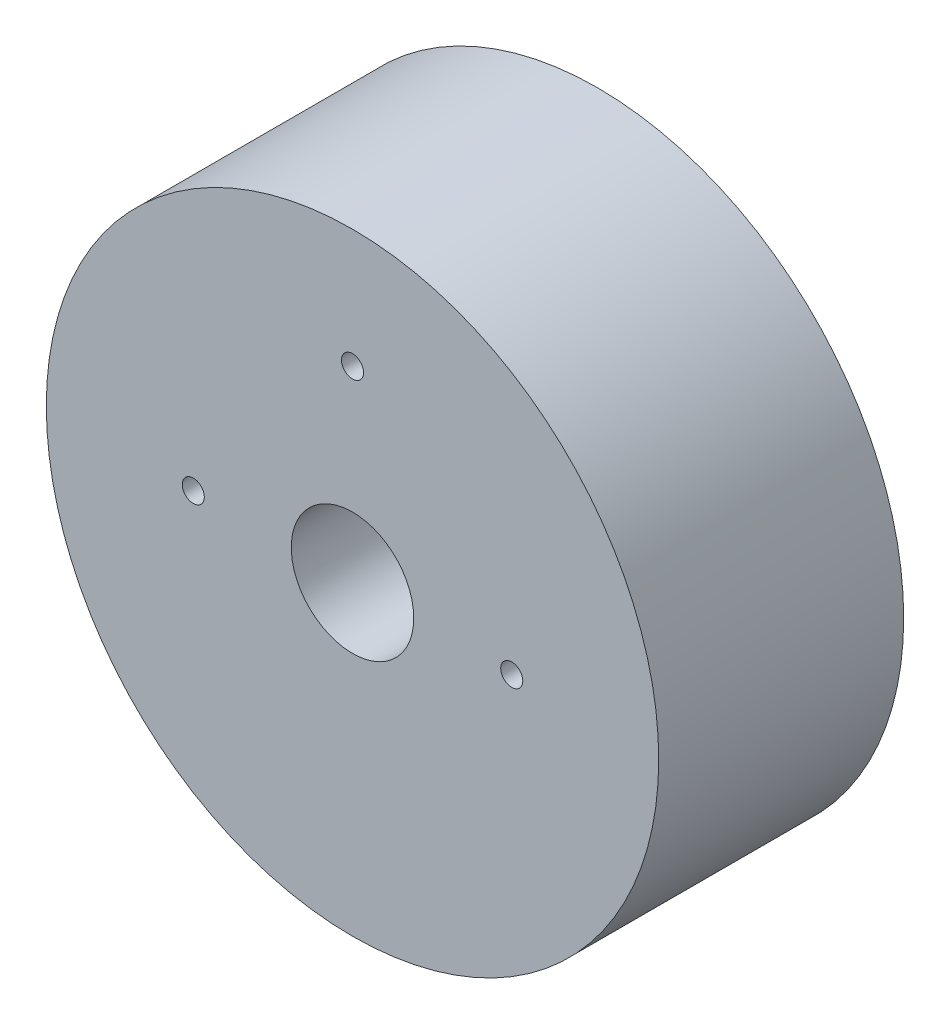
ISO-10303-21;
HEADER;
FILE_DESCRIPTION(('STEP AP214'),'2;1');
FILE_NAME('part.step','',(''),(''),'','','');
FILE_SCHEMA(('AUTOMOTIVE_DESIGN { 1 0 10303 214 1 1 1 1 }'));
ENDSEC;
DATA;
#1=APPLICATION_CONTEXT('core data for automotive mechanical design processes');
#2=APPLICATION_PROTOCOL_DEFINITION('international standard','automotive_design',2000,#1);
#3=PRODUCT_CONTEXT('',#1,'mechanical');
#4=PRODUCT('Part','Part','',(#3));
#5=PRODUCT_RELATED_PRODUCT_CATEGORY('part','',(#4));
#6=PRODUCT_DEFINITION_FORMATION('','',#4);
#7=PRODUCT_DEFINITION_CONTEXT('part definition',#1,'design');
#8=PRODUCT_DEFINITION('design','',#6,#7);
#9=PRODUCT_DEFINITION_SHAPE('','',#8);
#10=(LENGTH_UNIT() NAMED_UNIT(*) SI_UNIT(.MILLI.,.METRE.));
#11=(NAMED_UNIT(*) PLANE_ANGLE_UNIT() SI_UNIT($,.RADIAN.));
#12=(NAMED_UNIT(*) SI_UNIT($,.STERADIAN.) SOLID_ANGLE_UNIT());
#13=UNCERTAINTY_MEASURE_WITH_UNIT(LENGTH_MEASURE(1.E-05),#10,'distance_accuracy_value','');
#14=(GEOMETRIC_REPRESENTATION_CONTEXT(3) GLOBAL_UNCERTAINTY_ASSIGNED_CONTEXT((#13)) GLOBAL_UNIT_ASSIGNED_CONTEXT((#10,
#11,#12)) REPRESENTATION_CONTEXT('',''));
#15=CARTESIAN_POINT('',(0.,0.,0.));
#16=DIRECTION('',(0.,0.,1.));
#17=DIRECTION('',(1.,0.,0.));
#18=AXIS2_PLACEMENT_3D('',#15,#16,#17);
#19=CARTESIAN_POINT('',(0.,0.,50.8));
#20=DIRECTION('',(0.,0.,1.));
#21=DIRECTION('',(1.,0.,0.));
#22=AXIS2_PLACEMENT_3D('',#19,#20,#21);
#23=PLANE('',#22);
#24=CARTESIAN_POINT('',(0.,0.,50.8));
#25=DIRECTION('',(0.,0.,1.));
#26=DIRECTION('',(1.,0.,0.));
#27=AXIS2_PLACEMENT_3D('',#24,#25,#26);
#28=CIRCLE('',#27,12.7);
#29=CARTESIAN_POINT('',(12.7,0.,50.8));
#30=VERTEX_POINT('',#29);
#31=EDGE_CURVE('E62',#30,#30,#28,.T.);
#32=ORIENTED_EDGE('',*,*,#31,.F.);
#33=EDGE_LOOP('',(#32));
#34=FACE_BOUND('',#33,.T.);
#35=CARTESIAN_POINT('',(33.02,0.,50.8));
#36=DIRECTION('',(0.,0.,1.));
#37=DIRECTION('',(1.,0.,0.));
#38=AXIS2_PLACEMENT_3D('',#35,#36,#37);
#39=CIRCLE('',#38,2.286);
#40=CARTESIAN_POINT('',(35.306,0.,50.8));
#41=VERTEX_POINT('',#40);
#42=EDGE_CURVE('E47',#41,#41,#39,.T.);
#43=ORIENTED_EDGE('',*,*,#42,.F.);
#44=EDGE_LOOP('',(#43));
#45=FACE_BOUND('',#44,.T.);
#46=CARTESIAN_POINT('',(0.,0.,50.8));
#47=DIRECTION('',(0.,0.,1.));
#48=DIRECTION('',(1.,0.,0.));
#49=AXIS2_PLACEMENT_3D('',#46,#47,#48);
#50=CIRCLE('',#49,63.5);
#51=CARTESIAN_POINT('',(63.5,0.,50.8));
#52=VERTEX_POINT('',#51);
#53=EDGE_CURVE('E10',#52,#52,#50,.T.);
#54=ORIENTED_EDGE('',*,*,#53,.T.);
#55=EDGE_LOOP('',(#54));
#56=FACE_BOUND('',#55,.T.);
#57=CARTESIAN_POINT('',(-33.02,0.,50.8));
#58=DIRECTION('',(0.,0.,1.));
#59=DIRECTION('',(1.,0.,0.));
#60=AXIS2_PLACEMENT_3D('',#57,#58,#59);
#61=CIRCLE('',#60,2.286);
#62=CARTESIAN_POINT('',(-30.734,0.,50.8));
#63=VERTEX_POINT('',#62);
#64=EDGE_CURVE('E42',#63,#63,#61,.T.);
#65=ORIENTED_EDGE('',*,*,#64,.F.);
#66=EDGE_LOOP('',(#65));
#67=FACE_BOUND('',#66,.T.);
#68=CARTESIAN_POINT('',(0.,38.862,50.8));
#69=DIRECTION('',(0.,0.,1.));
#70=DIRECTION('',(1.,0.,0.));
#71=AXIS2_PLACEMENT_3D('',#68,#69,#70);
#72=CIRCLE('',#71,2.286);
#73=CARTESIAN_POINT('',(2.286,38.862,50.8));
#74=VERTEX_POINT('',#73);
#75=EDGE_CURVE('E53',#74,#74,#72,.T.);
#76=ORIENTED_EDGE('',*,*,#75,.F.);
#77=EDGE_LOOP('',(#76));
#78=FACE_BOUND('',#77,.T.);
#79=ADVANCED_FACE('F31',(#34,#45,#56,#67,#78),#23,.T.);
#80=CARTESIAN_POINT('',(0.,0.,0.));
#81=DIRECTION('',(0.,0.,1.));
#82=DIRECTION('',(1.,0.,0.));
#83=AXIS2_PLACEMENT_3D('',#80,#81,#82);
#84=PLANE('',#83);
#85=CARTESIAN_POINT('',(0.,0.,0.));
#86=DIRECTION('',(0.,0.,1.));
#87=DIRECTION('',(1.,0.,0.));
#88=AXIS2_PLACEMENT_3D('',#85,#86,#87);
#89=CIRCLE('',#88,12.7);
#90=CARTESIAN_POINT('',(12.7,0.,0.));
#91=VERTEX_POINT('',#90);
#92=EDGE_CURVE('E59',#91,#91,#89,.T.);
#93=ORIENTED_EDGE('',*,*,#92,.T.);
#94=EDGE_LOOP('',(#93));
#95=FACE_BOUND('',#94,.T.);
#96=CARTESIAN_POINT('',(0.,0.,0.));
#97=DIRECTION('',(0.,0.,1.));
#98=DIRECTION('',(1.,0.,0.));
#99=AXIS2_PLACEMENT_3D('',#96,#97,#98);
#100=CIRCLE('',#99,63.5);
#101=CARTESIAN_POINT('',(63.5,0.,0.));
#102=VERTEX_POINT('',#101);
#103=EDGE_CURVE('E35',#102,#102,#100,.T.);
#104=ORIENTED_EDGE('',*,*,#103,.F.);
#105=EDGE_LOOP('',(#104));
#106=FACE_BOUND('',#105,.T.);
#107=CARTESIAN_POINT('',(-33.02,0.,0.));
#108=DIRECTION('',(0.,0.,1.));
#109=DIRECTION('',(1.,0.,0.));
#110=AXIS2_PLACEMENT_3D('',#107,#108,#109);
#111=CIRCLE('',#110,2.286);
#112=CARTESIAN_POINT('',(-30.734,0.,0.));
#113=VERTEX_POINT('',#112);
#114=EDGE_CURVE('E44',#113,#113,#111,.T.);
#115=ORIENTED_EDGE('',*,*,#114,.T.);
#116=EDGE_LOOP('',(#115));
#117=FACE_BOUND('',#116,.T.);
#118=CARTESIAN_POINT('',(33.02,0.,0.));
#119=DIRECTION('',(0.,0.,1.));
#120=DIRECTION('',(1.,0.,0.));
#121=AXIS2_PLACEMENT_3D('',#118,#119,#120);
#122=CIRCLE('',#121,2.286);
#123=CARTESIAN_POINT('',(35.306,0.,0.));
#124=VERTEX_POINT('',#123);
#125=EDGE_CURVE('E50',#124,#124,#122,.T.);
#126=ORIENTED_EDGE('',*,*,#125,.T.);
#127=EDGE_LOOP('',(#126));
#128=FACE_BOUND('',#127,.T.);
#129=CARTESIAN_POINT('',(0.,38.862,0.));
#130=DIRECTION('',(0.,0.,1.));
#131=DIRECTION('',(1.,0.,0.));
#132=AXIS2_PLACEMENT_3D('',#129,#130,#131);
#133=CIRCLE('',#132,2.286);
#134=CARTESIAN_POINT('',(2.286,38.862,0.));
#135=VERTEX_POINT('',#134);
#136=EDGE_CURVE('E56',#135,#135,#133,.T.);
#137=ORIENTED_EDGE('',*,*,#136,.T.);
#138=EDGE_LOOP('',(#137));
#139=FACE_BOUND('',#138,.T.);
#140=ADVANCED_FACE('F68',(#95,#106,#117,#128,#139),#84,.F.);
#141=CARTESIAN_POINT('',(0.,0.,50.8));
#142=DIRECTION('',(0.,0.,-1.));
#143=DIRECTION('',(-1.,0.,0.));
#144=AXIS2_PLACEMENT_3D('',#141,#142,#143);
#145=CYLINDRICAL_SURFACE('',#144,63.5);
#146=ORIENTED_EDGE('',*,*,#53,.F.);
#147=EDGE_LOOP('',(#146));
#148=FACE_BOUND('',#147,.T.);
#149=ORIENTED_EDGE('',*,*,#103,.T.);
#150=EDGE_LOOP('',(#149));
#151=FACE_BOUND('',#150,.T.);
#152=ADVANCED_FACE('F33',(#148,#151),#145,.T.);
#153=CARTESIAN_POINT('',(-33.02,0.,50.8));
#154=DIRECTION('',(0.,0.,-1.));
#155=DIRECTION('',(-1.,0.,0.));
#156=AXIS2_PLACEMENT_3D('',#153,#154,#155);
#157=CYLINDRICAL_SURFACE('',#156,2.286);
#158=ORIENTED_EDGE('',*,*,#64,.T.);
#159=EDGE_LOOP('',(#158));
#160=FACE_BOUND('',#159,.T.);
#161=ORIENTED_EDGE('',*,*,#114,.F.);
#162=EDGE_LOOP('',(#161));
#163=FACE_BOUND('',#162,.T.);
#164=ADVANCED_FACE('F97',(#160,#163),#157,.F.);
#165=CARTESIAN_POINT('',(33.02,0.,50.8));
#166=DIRECTION('',(0.,0.,-1.));
#167=DIRECTION('',(-1.,0.,0.));
#168=AXIS2_PLACEMENT_3D('',#165,#166,#167);
#169=CYLINDRICAL_SURFACE('',#168,2.286);
#170=ORIENTED_EDGE('',*,*,#42,.T.);
#171=EDGE_LOOP('',(#170));
#172=FACE_BOUND('',#171,.T.);
#173=ORIENTED_EDGE('',*,*,#125,.F.);
#174=EDGE_LOOP('',(#173));
#175=FACE_BOUND('',#174,.T.);
#176=ADVANCED_FACE('F89',(#172,#175),#169,.F.);
#177=CARTESIAN_POINT('',(0.,38.862,50.8));
#178=DIRECTION('',(0.,0.,-1.));
#179=DIRECTION('',(-1.,0.,0.));
#180=AXIS2_PLACEMENT_3D('',#177,#178,#179);
#181=CYLINDRICAL_SURFACE('',#180,2.286);
#182=ORIENTED_EDGE('',*,*,#75,.T.);
#183=EDGE_LOOP('',(#182));
#184=FACE_BOUND('',#183,.T.);
#185=ORIENTED_EDGE('',*,*,#136,.F.);
#186=EDGE_LOOP('',(#185));
#187=FACE_BOUND('',#186,.T.);
#188=ADVANCED_FACE('F74',(#184,#187),#181,.F.);
#189=CARTESIAN_POINT('',(0.,0.,0.));
#190=DIRECTION('',(0.,0.,1.));
#191=DIRECTION('',(1.,0.,0.));
#192=AXIS2_PLACEMENT_3D('',#189,#190,#191);
#193=CYLINDRICAL_SURFACE('',#192,12.7);
#194=ORIENTED_EDGE('',*,*,#92,.F.);
#195=EDGE_LOOP('',(#194));
#196=FACE_BOUND('',#195,.T.);
#197=ORIENTED_EDGE('',*,*,#31,.T.);
#198=EDGE_LOOP('',(#197));
#199=FACE_BOUND('',#198,.T.);
#200=ADVANCED_FACE('F71',(#196,#199),#193,.F.);
#201=CLOSED_SHELL('',(#79,#140,#152,#164,#176,#188,#200));
#202=MANIFOLD_SOLID_BREP('B2',#201);
#203=ADVANCED_BREP_SHAPE_REPRESENTATION('',(#18,#202),#14);
#204=SHAPE_DEFINITION_REPRESENTATION(#9,#203);
ENDSEC;
END-ISO-10303-21;
